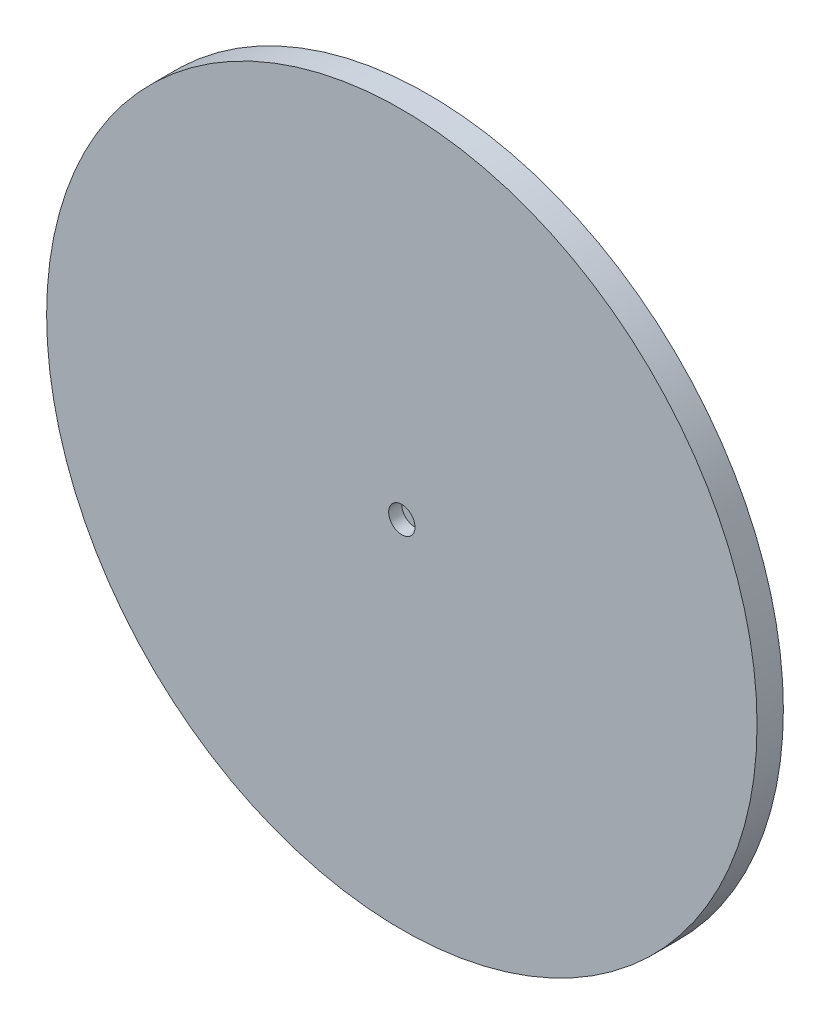
ISO-10303-21;
HEADER;
FILE_DESCRIPTION(('STEP AP214'),'2;1');
FILE_NAME('part.step','',(''),(''),'','','');
FILE_SCHEMA(('AUTOMOTIVE_DESIGN { 1 0 10303 214 1 1 1 1 }'));
ENDSEC;
DATA;
#1=APPLICATION_CONTEXT('core data for automotive mechanical design processes');
#2=APPLICATION_PROTOCOL_DEFINITION('international standard','automotive_design',2000,#1);
#3=PRODUCT_CONTEXT('',#1,'mechanical');
#4=PRODUCT('Part','Part','',(#3));
#5=PRODUCT_RELATED_PRODUCT_CATEGORY('part','',(#4));
#6=PRODUCT_DEFINITION_FORMATION('','',#4);
#7=PRODUCT_DEFINITION_CONTEXT('part definition',#1,'design');
#8=PRODUCT_DEFINITION('design','',#6,#7);
#9=PRODUCT_DEFINITION_SHAPE('','',#8);
#10=(LENGTH_UNIT() NAMED_UNIT(*) SI_UNIT(.MILLI.,.METRE.));
#11=(NAMED_UNIT(*) PLANE_ANGLE_UNIT() SI_UNIT($,.RADIAN.));
#12=(NAMED_UNIT(*) SI_UNIT($,.STERADIAN.) SOLID_ANGLE_UNIT());
#13=UNCERTAINTY_MEASURE_WITH_UNIT(LENGTH_MEASURE(1.E-05),#10,'distance_accuracy_value','');
#14=(GEOMETRIC_REPRESENTATION_CONTEXT(3) GLOBAL_UNCERTAINTY_ASSIGNED_CONTEXT((#13)) GLOBAL_UNIT_ASSIGNED_CONTEXT((#10,
#11,#12)) REPRESENTATION_CONTEXT('',''));
#15=CARTESIAN_POINT('',(0.,0.,0.));
#16=DIRECTION('',(0.,0.,1.));
#17=DIRECTION('',(1.,0.,0.));
#18=AXIS2_PLACEMENT_3D('',#15,#16,#17);
#19=CARTESIAN_POINT('',(0.,0.,2.));
#20=DIRECTION('',(0.,0.,-1.));
#21=DIRECTION('',(-1.,0.,0.));
#22=AXIS2_PLACEMENT_3D('',#19,#20,#21);
#23=CYLINDRICAL_SURFACE('',#22,27.);
#24=CARTESIAN_POINT('',(0.,0.,2.));
#25=DIRECTION('',(0.,0.,1.));
#26=DIRECTION('',(1.,0.,0.));
#27=AXIS2_PLACEMENT_3D('',#24,#25,#26);
#28=CIRCLE('',#27,27.);
#29=CARTESIAN_POINT('',(27.,0.,2.));
#30=VERTEX_POINT('',#29);
#31=EDGE_CURVE('E44',#30,#30,#28,.T.);
#32=ORIENTED_EDGE('',*,*,#31,.F.);
#33=EDGE_LOOP('',(#32));
#34=FACE_BOUND('',#33,.T.);
#35=CARTESIAN_POINT('',(0.,0.,0.));
#36=DIRECTION('',(0.,0.,1.));
#37=DIRECTION('',(1.,0.,0.));
#38=AXIS2_PLACEMENT_3D('',#35,#36,#37);
#39=CIRCLE('',#38,27.);
#40=CARTESIAN_POINT('',(27.,0.,0.));
#41=VERTEX_POINT('',#40);
#42=EDGE_CURVE('E40',#41,#41,#39,.T.);
#43=ORIENTED_EDGE('',*,*,#42,.T.);
#44=EDGE_LOOP('',(#43));
#45=FACE_BOUND('',#44,.T.);
#46=ADVANCED_FACE('F37',(#34,#45),#23,.T.);
#47=CARTESIAN_POINT('',(0.,0.,2.));
#48=DIRECTION('',(0.,0.,1.));
#49=DIRECTION('',(1.,0.,0.));
#50=AXIS2_PLACEMENT_3D('',#47,#48,#49);
#51=PLANE('',#50);
#52=CARTESIAN_POINT('',(0.,0.,2.));
#53=DIRECTION('',(0.,0.,1.));
#54=DIRECTION('',(1.,0.,0.));
#55=AXIS2_PLACEMENT_3D('',#52,#53,#54);
#56=CIRCLE('',#55,1.);
#57=CARTESIAN_POINT('',(1.,0.,2.));
#58=VERTEX_POINT('',#57);
#59=EDGE_CURVE('E54',#58,#58,#56,.T.);
#60=ORIENTED_EDGE('',*,*,#59,.F.);
#61=EDGE_LOOP('',(#60));
#62=FACE_BOUND('',#61,.T.);
#63=ORIENTED_EDGE('',*,*,#31,.T.);
#64=EDGE_LOOP('',(#63));
#65=FACE_BOUND('',#64,.T.);
#66=ADVANCED_FACE('F69',(#62,#65),#51,.T.);
#67=CARTESIAN_POINT('',(0.,0.,0.));
#68=DIRECTION('',(0.,0.,1.));
#69=DIRECTION('',(1.,0.,0.));
#70=AXIS2_PLACEMENT_3D('',#67,#68,#69);
#71=PLANE('',#70);
#72=CARTESIAN_POINT('',(0.,0.,0.));
#73=DIRECTION('',(0.,0.,-1.));
#74=DIRECTION('',(-1.,0.,0.));
#75=AXIS2_PLACEMENT_3D('',#72,#73,#74);
#76=CIRCLE('',#75,5.);
#77=CARTESIAN_POINT('',(-5.,0.,0.));
#78=VERTEX_POINT('',#77);
#79=EDGE_CURVE('E10',#78,#78,#76,.T.);
#80=ORIENTED_EDGE('',*,*,#79,.F.);
#81=EDGE_LOOP('',(#80));
#82=FACE_BOUND('',#81,.T.);
#83=ORIENTED_EDGE('',*,*,#42,.F.);
#84=EDGE_LOOP('',(#83));
#85=FACE_BOUND('',#84,.T.);
#86=ADVANCED_FACE('F72',(#82,#85),#71,.F.);
#87=CARTESIAN_POINT('',(0.,0.,-1.));
#88=DIRECTION('',(0.,0.,1.));
#89=DIRECTION('',(1.,0.,0.));
#90=AXIS2_PLACEMENT_3D('',#87,#88,#89);
#91=CYLINDRICAL_SURFACE('',#90,5.);
#92=CARTESIAN_POINT('',(0.,0.,-1.));
#93=DIRECTION('',(0.,0.,-1.));
#94=DIRECTION('',(-1.,0.,0.));
#95=AXIS2_PLACEMENT_3D('',#92,#93,#94);
#96=CIRCLE('',#95,5.);
#97=CARTESIAN_POINT('',(-5.,0.,-1.));
#98=VERTEX_POINT('',#97);
#99=EDGE_CURVE('E50',#98,#98,#96,.T.);
#100=ORIENTED_EDGE('',*,*,#99,.F.);
#101=EDGE_LOOP('',(#100));
#102=FACE_BOUND('',#101,.T.);
#103=ORIENTED_EDGE('',*,*,#79,.T.);
#104=EDGE_LOOP('',(#103));
#105=FACE_BOUND('',#104,.T.);
#106=ADVANCED_FACE('F82',(#102,#105),#91,.T.);
#107=CARTESIAN_POINT('',(0.,0.,-1.));
#108=DIRECTION('',(0.,0.,-1.));
#109=DIRECTION('',(-1.,0.,0.));
#110=AXIS2_PLACEMENT_3D('',#107,#108,#109);
#111=PLANE('',#110);
#112=ORIENTED_EDGE('',*,*,#99,.T.);
#113=EDGE_LOOP('',(#112));
#114=FACE_BOUND('',#113,.T.);
#115=ADVANCED_FACE('F65',(#114),#111,.T.);
#116=CARTESIAN_POINT('',(0.,0.,1.));
#117=DIRECTION('',(0.,0.,1.));
#118=DIRECTION('',(1.,0.,0.));
#119=AXIS2_PLACEMENT_3D('',#116,#117,#118);
#120=CYLINDRICAL_SURFACE('',#119,1.);
#121=CARTESIAN_POINT('',(0.,0.,1.));
#122=DIRECTION('',(0.,0.,1.));
#123=DIRECTION('',(1.,0.,0.));
#124=AXIS2_PLACEMENT_3D('',#121,#122,#123);
#125=CIRCLE('',#124,1.);
#126=CARTESIAN_POINT('',(1.,0.,1.));
#127=VERTEX_POINT('',#126);
#128=EDGE_CURVE('E53',#127,#127,#125,.T.);
#129=ORIENTED_EDGE('',*,*,#128,.F.);
#130=EDGE_LOOP('',(#129));
#131=FACE_BOUND('',#130,.T.);
#132=ORIENTED_EDGE('',*,*,#59,.T.);
#133=EDGE_LOOP('',(#132));
#134=FACE_BOUND('',#133,.T.);
#135=ADVANCED_FACE('F62',(#131,#134),#120,.F.);
#136=CARTESIAN_POINT('',(0.,0.,1.));
#137=DIRECTION('',(0.,0.,1.));
#138=DIRECTION('',(1.,0.,0.));
#139=AXIS2_PLACEMENT_3D('',#136,#137,#138);
#140=PLANE('',#139);
#141=ORIENTED_EDGE('',*,*,#128,.T.);
#142=EDGE_LOOP('',(#141));
#143=FACE_BOUND('',#142,.T.);
#144=ADVANCED_FACE('F60',(#143),#140,.T.);
#145=CLOSED_SHELL('',(#46,#66,#86,#106,#115,#135,#144));
#146=MANIFOLD_SOLID_BREP('B2',#145);
#147=ADVANCED_BREP_SHAPE_REPRESENTATION('',(#18,#146),#14);
#148=SHAPE_DEFINITION_REPRESENTATION(#9,#147);
ENDSEC;
END-ISO-10303-21;
